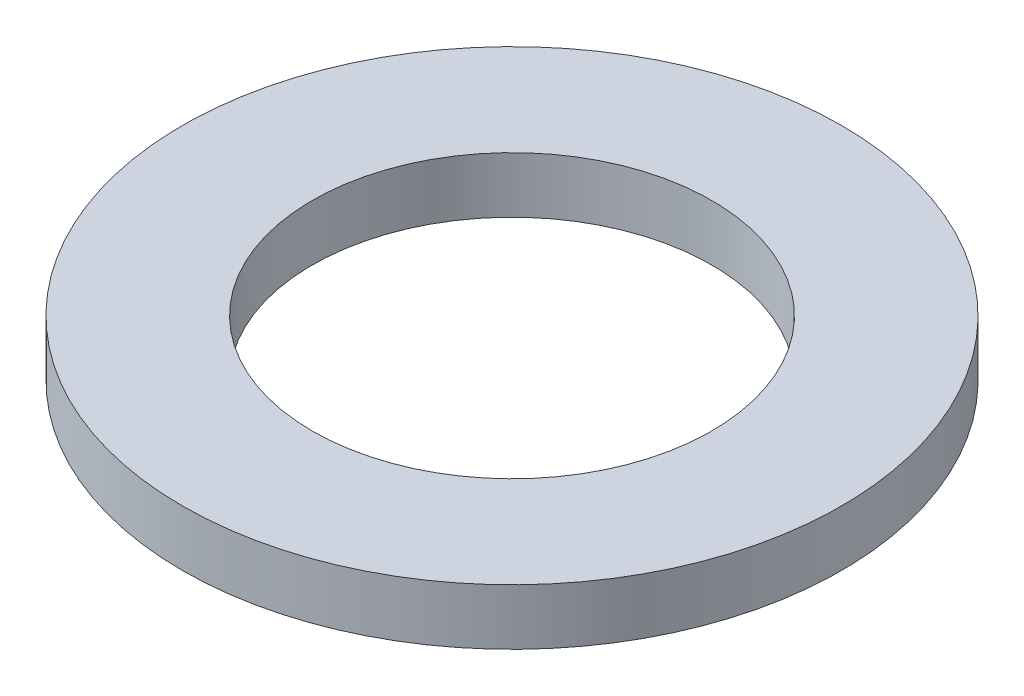
ISO-10303-21;
HEADER;
FILE_DESCRIPTION(('STEP AP214'),'2;1');
FILE_NAME('part.step','',(''),(''),'','','');
FILE_SCHEMA(('AUTOMOTIVE_DESIGN { 1 0 10303 214 1 1 1 1 }'));
ENDSEC;
DATA;
#1=APPLICATION_CONTEXT('core data for automotive mechanical design processes');
#2=APPLICATION_PROTOCOL_DEFINITION('international standard','automotive_design',2000,#1);
#3=PRODUCT_CONTEXT('',#1,'mechanical');
#4=PRODUCT('Part','Part','',(#3));
#5=PRODUCT_RELATED_PRODUCT_CATEGORY('part','',(#4));
#6=PRODUCT_DEFINITION_FORMATION('','',#4);
#7=PRODUCT_DEFINITION_CONTEXT('part definition',#1,'design');
#8=PRODUCT_DEFINITION('design','',#6,#7);
#9=PRODUCT_DEFINITION_SHAPE('','',#8);
#10=(LENGTH_UNIT() NAMED_UNIT(*) SI_UNIT(.MILLI.,.METRE.));
#11=(NAMED_UNIT(*) PLANE_ANGLE_UNIT() SI_UNIT($,.RADIAN.));
#12=(NAMED_UNIT(*) SI_UNIT($,.STERADIAN.) SOLID_ANGLE_UNIT());
#13=UNCERTAINTY_MEASURE_WITH_UNIT(LENGTH_MEASURE(1.E-05),#10,'distance_accuracy_value','');
#14=(GEOMETRIC_REPRESENTATION_CONTEXT(3) GLOBAL_UNCERTAINTY_ASSIGNED_CONTEXT((#13)) GLOBAL_UNIT_ASSIGNED_CONTEXT((#10,
#11,#12)) REPRESENTATION_CONTEXT('',''));
#15=CARTESIAN_POINT('',(0.,0.,0.));
#16=DIRECTION('',(0.,0.,1.));
#17=DIRECTION('',(1.,0.,0.));
#18=AXIS2_PLACEMENT_3D('',#15,#16,#17);
#19=CARTESIAN_POINT('',(0.,14.,0.));
#20=DIRECTION('',(0.,-1.,0.));
#21=DIRECTION('',(0.,0.,-1.));
#22=AXIS2_PLACEMENT_3D('',#19,#20,#21);
#23=CYLINDRICAL_SURFACE('',#22,82.5);
#24=CARTESIAN_POINT('',(0.,14.,0.));
#25=DIRECTION('',(0.,1.,0.));
#26=DIRECTION('',(0.,0.,1.));
#27=AXIS2_PLACEMENT_3D('',#24,#25,#26);
#28=CIRCLE('',#27,82.5);
#29=CARTESIAN_POINT('',(0.,14.,82.5));
#30=VERTEX_POINT('',#29);
#31=EDGE_CURVE('E10',#30,#30,#28,.T.);
#32=ORIENTED_EDGE('',*,*,#31,.F.);
#33=EDGE_LOOP('',(#32));
#34=FACE_BOUND('',#33,.T.);
#35=CARTESIAN_POINT('',(0.,0.,0.));
#36=DIRECTION('',(0.,1.,0.));
#37=DIRECTION('',(0.,0.,1.));
#38=AXIS2_PLACEMENT_3D('',#35,#36,#37);
#39=CIRCLE('',#38,82.5);
#40=CARTESIAN_POINT('',(0.,0.,82.5));
#41=VERTEX_POINT('',#40);
#42=EDGE_CURVE('E37',#41,#41,#39,.T.);
#43=ORIENTED_EDGE('',*,*,#42,.T.);
#44=EDGE_LOOP('',(#43));
#45=FACE_BOUND('',#44,.T.);
#46=ADVANCED_FACE('F40',(#34,#45),#23,.T.);
#47=CARTESIAN_POINT('',(0.,14.,0.));
#48=DIRECTION('',(0.,1.,0.));
#49=DIRECTION('',(0.,0.,1.));
#50=AXIS2_PLACEMENT_3D('',#47,#48,#49);
#51=PLANE('',#50);
#52=CARTESIAN_POINT('',(0.,14.,0.));
#53=DIRECTION('',(0.,1.,0.));
#54=DIRECTION('',(0.,0.,1.));
#55=AXIS2_PLACEMENT_3D('',#52,#53,#54);
#56=CIRCLE('',#55,50.);
#57=CARTESIAN_POINT('',(0.,14.,50.));
#58=VERTEX_POINT('',#57);
#59=EDGE_CURVE('E50',#58,#58,#56,.T.);
#60=ORIENTED_EDGE('',*,*,#59,.F.);
#61=EDGE_LOOP('',(#60));
#62=FACE_BOUND('',#61,.T.);
#63=ORIENTED_EDGE('',*,*,#31,.T.);
#64=EDGE_LOOP('',(#63));
#65=FACE_BOUND('',#64,.T.);
#66=ADVANCED_FACE('F59',(#62,#65),#51,.T.);
#67=CARTESIAN_POINT('',(0.,0.,0.));
#68=DIRECTION('',(0.,1.,0.));
#69=DIRECTION('',(0.,0.,1.));
#70=AXIS2_PLACEMENT_3D('',#67,#68,#69);
#71=PLANE('',#70);
#72=CARTESIAN_POINT('',(0.,0.,0.));
#73=DIRECTION('',(0.,1.,0.));
#74=DIRECTION('',(0.,0.,1.));
#75=AXIS2_PLACEMENT_3D('',#72,#73,#74);
#76=CIRCLE('',#75,50.);
#77=CARTESIAN_POINT('',(0.,0.,50.));
#78=VERTEX_POINT('',#77);
#79=EDGE_CURVE('E47',#78,#78,#76,.T.);
#80=ORIENTED_EDGE('',*,*,#79,.T.);
#81=EDGE_LOOP('',(#80));
#82=FACE_BOUND('',#81,.T.);
#83=ORIENTED_EDGE('',*,*,#42,.F.);
#84=EDGE_LOOP('',(#83));
#85=FACE_BOUND('',#84,.T.);
#86=ADVANCED_FACE('F58',(#82,#85),#71,.F.);
#87=CARTESIAN_POINT('',(0.,14.,0.));
#88=DIRECTION('',(0.,-1.,0.));
#89=DIRECTION('',(0.,0.,-1.));
#90=AXIS2_PLACEMENT_3D('',#87,#88,#89);
#91=CYLINDRICAL_SURFACE('',#90,50.);
#92=ORIENTED_EDGE('',*,*,#59,.T.);
#93=EDGE_LOOP('',(#92));
#94=FACE_BOUND('',#93,.T.);
#95=ORIENTED_EDGE('',*,*,#79,.F.);
#96=EDGE_LOOP('',(#95));
#97=FACE_BOUND('',#96,.T.);
#98=ADVANCED_FACE('F54',(#94,#97),#91,.F.);
#99=CLOSED_SHELL('',(#46,#66,#86,#98));
#100=MANIFOLD_SOLID_BREP('B2',#99);
#101=ADVANCED_BREP_SHAPE_REPRESENTATION('',(#18,#100),#14);
#102=SHAPE_DEFINITION_REPRESENTATION(#9,#101);
ENDSEC;
END-ISO-10303-21;
